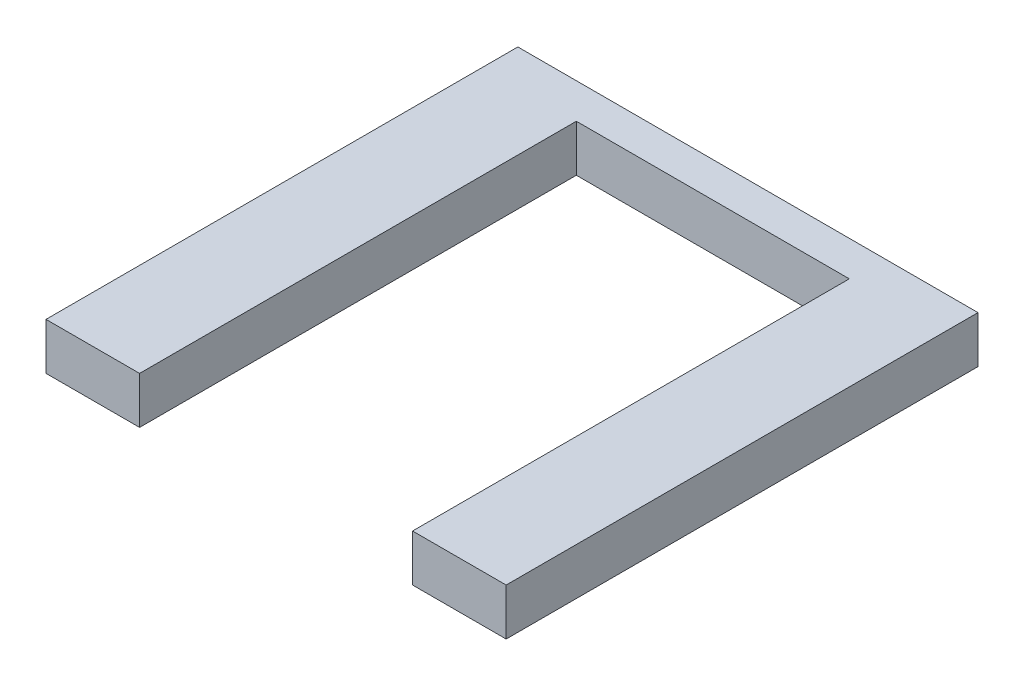
ISO-10303-21;
HEADER;
FILE_DESCRIPTION(('STEP AP214'),'2;1');
FILE_NAME('part.step','',(''),(''),'','','');
FILE_SCHEMA(('AUTOMOTIVE_DESIGN { 1 0 10303 214 1 1 1 1 }'));
ENDSEC;
DATA;
#1=APPLICATION_CONTEXT('core data for automotive mechanical design processes');
#2=APPLICATION_PROTOCOL_DEFINITION('international standard','automotive_design',2000,#1);
#3=PRODUCT_CONTEXT('',#1,'mechanical');
#4=PRODUCT('Part','Part','',(#3));
#5=PRODUCT_RELATED_PRODUCT_CATEGORY('part','',(#4));
#6=PRODUCT_DEFINITION_FORMATION('','',#4);
#7=PRODUCT_DEFINITION_CONTEXT('part definition',#1,'design');
#8=PRODUCT_DEFINITION('design','',#6,#7);
#9=PRODUCT_DEFINITION_SHAPE('','',#8);
#10=(LENGTH_UNIT() NAMED_UNIT(*) SI_UNIT(.MILLI.,.METRE.));
#11=(NAMED_UNIT(*) PLANE_ANGLE_UNIT() SI_UNIT($,.RADIAN.));
#12=(NAMED_UNIT(*) SI_UNIT($,.STERADIAN.) SOLID_ANGLE_UNIT());
#13=UNCERTAINTY_MEASURE_WITH_UNIT(LENGTH_MEASURE(1.E-05),#10,'distance_accuracy_value','');
#14=(GEOMETRIC_REPRESENTATION_CONTEXT(3) GLOBAL_UNCERTAINTY_ASSIGNED_CONTEXT((#13)) GLOBAL_UNIT_ASSIGNED_CONTEXT((#10,
#11,#12)) REPRESENTATION_CONTEXT('',''));
#15=CARTESIAN_POINT('',(0.,0.,0.));
#16=DIRECTION('',(0.,0.,1.));
#17=DIRECTION('',(1.,0.,0.));
#18=AXIS2_PLACEMENT_3D('',#15,#16,#17);
#19=CARTESIAN_POINT('',(0.,76.2,768.35));
#20=DIRECTION('',(0.,0.,-1.));
#21=DIRECTION('',(-1.,0.,0.));
#22=AXIS2_PLACEMENT_3D('',#19,#20,#21);
#23=PLANE('',#22);
#24=DIRECTION('',(1.,0.,0.));
#25=VECTOR('',#24,1.);
#26=CARTESIAN_POINT('',(0.,0.,768.35));
#27=LINE('',#26,#25);
#28=CARTESIAN_POINT('',(0.,0.,768.35));
#29=VERTEX_POINT('',#28);
#30=CARTESIAN_POINT('',(152.4,0.,768.35));
#31=VERTEX_POINT('',#30);
#32=EDGE_CURVE('E134',#29,#31,#27,.T.);
#33=ORIENTED_EDGE('',*,*,#32,.T.);
#34=DIRECTION('',(0.,1.,0.));
#35=VECTOR('',#34,1.);
#36=CARTESIAN_POINT('',(152.4,0.,768.35));
#37=LINE('',#36,#35);
#38=CARTESIAN_POINT('',(152.4,76.2,768.35));
#39=VERTEX_POINT('',#38);
#40=EDGE_CURVE('E121',#31,#39,#37,.T.);
#41=ORIENTED_EDGE('',*,*,#40,.T.);
#42=DIRECTION('',(1.,0.,0.));
#43=VECTOR('',#42,1.);
#44=CARTESIAN_POINT('',(0.,76.2,768.35));
#45=LINE('',#44,#43);
#46=CARTESIAN_POINT('',(0.,76.2,768.35));
#47=VERTEX_POINT('',#46);
#48=EDGE_CURVE('E98',#47,#39,#45,.T.);
#49=ORIENTED_EDGE('',*,*,#48,.F.);
#50=DIRECTION('',(0.,-1.,0.));
#51=VECTOR('',#50,1.);
#52=CARTESIAN_POINT('',(0.,76.2,768.35));
#53=LINE('',#52,#51);
#54=EDGE_CURVE('E11',#47,#29,#53,.T.);
#55=ORIENTED_EDGE('',*,*,#54,.T.);
#56=EDGE_LOOP('',(#33,#41,#49,#55));
#57=FACE_BOUND('',#56,.T.);
#58=ADVANCED_FACE('F38',(#57),#23,.F.);
#59=CARTESIAN_POINT('',(0.,76.2,0.));
#60=DIRECTION('',(1.,0.,0.));
#61=DIRECTION('',(0.,0.,-1.));
#62=AXIS2_PLACEMENT_3D('',#59,#60,#61);
#63=PLANE('',#62);
#64=DIRECTION('',(0.,0.,1.));
#65=VECTOR('',#64,1.);
#66=CARTESIAN_POINT('',(0.,0.,0.));
#67=LINE('',#66,#65);
#68=CARTESIAN_POINT('',(0.,0.,0.));
#69=VERTEX_POINT('',#68);
#70=EDGE_CURVE('E148',#69,#29,#67,.T.);
#71=ORIENTED_EDGE('',*,*,#70,.T.);
#72=ORIENTED_EDGE('',*,*,#54,.F.);
#73=DIRECTION('',(0.,0.,1.));
#74=VECTOR('',#73,1.);
#75=CARTESIAN_POINT('',(0.,76.2,0.));
#76=LINE('',#75,#74);
#77=CARTESIAN_POINT('',(0.,76.2,0.));
#78=VERTEX_POINT('',#77);
#79=EDGE_CURVE('E154',#78,#47,#76,.T.);
#80=ORIENTED_EDGE('',*,*,#79,.F.);
#81=DIRECTION('',(0.,-1.,0.));
#82=VECTOR('',#81,1.);
#83=CARTESIAN_POINT('',(0.,76.2,0.));
#84=LINE('',#83,#82);
#85=EDGE_CURVE('E155',#78,#69,#84,.T.);
#86=ORIENTED_EDGE('',*,*,#85,.T.);
#87=EDGE_LOOP('',(#71,#72,#80,#86));
#88=FACE_BOUND('',#87,.T.);
#89=ADVANCED_FACE('F40',(#88),#63,.F.);
#90=CARTESIAN_POINT('',(596.9,76.2,768.35));
#91=VERTEX_POINT('',#90);
#92=CARTESIAN_POINT('',(749.3,76.2,768.35));
#93=VERTEX_POINT('',#92);
#94=EDGE_CURVE('E186',#91,#93,#45,.T.);
#95=ORIENTED_EDGE('',*,*,#94,.F.);
#96=DIRECTION('',(0.,1.,0.));
#97=VECTOR('',#96,1.);
#98=CARTESIAN_POINT('',(596.9,0.,768.35));
#99=LINE('',#98,#97);
#100=CARTESIAN_POINT('',(596.9,0.,768.35));
#101=VERTEX_POINT('',#100);
#102=EDGE_CURVE('E129',#101,#91,#99,.T.);
#103=ORIENTED_EDGE('',*,*,#102,.F.);
#104=CARTESIAN_POINT('',(749.3,0.,768.35));
#105=VERTEX_POINT('',#104);
#106=EDGE_CURVE('E144',#101,#105,#27,.T.);
#107=ORIENTED_EDGE('',*,*,#106,.T.);
#108=DIRECTION('',(0.,-1.,0.));
#109=VECTOR('',#108,1.);
#110=CARTESIAN_POINT('',(749.3,76.2,768.35));
#111=LINE('',#110,#109);
#112=EDGE_CURVE('E47',#93,#105,#111,.T.);
#113=ORIENTED_EDGE('',*,*,#112,.F.);
#114=EDGE_LOOP('',(#95,#103,#107,#113));
#115=FACE_BOUND('',#114,.T.);
#116=ADVANCED_FACE('F205',(#115),#23,.F.);
#117=CARTESIAN_POINT('',(749.3,76.2,0.));
#118=DIRECTION('',(-1.,0.,0.));
#119=DIRECTION('',(0.,0.,1.));
#120=AXIS2_PLACEMENT_3D('',#117,#118,#119);
#121=PLANE('',#120);
#122=DIRECTION('',(0.,0.,-1.));
#123=VECTOR('',#122,1.);
#124=CARTESIAN_POINT('',(749.3,0.,0.));
#125=LINE('',#124,#123);
#126=CARTESIAN_POINT('',(749.3,0.,0.));
#127=VERTEX_POINT('',#126);
#128=EDGE_CURVE('E143',#105,#127,#125,.T.);
#129=ORIENTED_EDGE('',*,*,#128,.T.);
#130=DIRECTION('',(0.,-1.,0.));
#131=VECTOR('',#130,1.);
#132=CARTESIAN_POINT('',(749.3,76.2,0.));
#133=LINE('',#132,#131);
#134=CARTESIAN_POINT('',(749.3,76.2,0.));
#135=VERTEX_POINT('',#134);
#136=EDGE_CURVE('E158',#135,#127,#133,.T.);
#137=ORIENTED_EDGE('',*,*,#136,.F.);
#138=DIRECTION('',(0.,0.,-1.));
#139=VECTOR('',#138,1.);
#140=CARTESIAN_POINT('',(749.3,76.2,0.));
#141=LINE('',#140,#139);
#142=EDGE_CURVE('E166',#93,#135,#141,.T.);
#143=ORIENTED_EDGE('',*,*,#142,.F.);
#144=ORIENTED_EDGE('',*,*,#112,.T.);
#145=EDGE_LOOP('',(#129,#137,#143,#144));
#146=FACE_BOUND('',#145,.T.);
#147=ADVANCED_FACE('F164',(#146),#121,.F.);
#148=CARTESIAN_POINT('',(0.,76.2,0.));
#149=DIRECTION('',(0.,0.,1.));
#150=DIRECTION('',(1.,0.,0.));
#151=AXIS2_PLACEMENT_3D('',#148,#149,#150);
#152=PLANE('',#151);
#153=DIRECTION('',(-1.,0.,0.));
#154=VECTOR('',#153,1.);
#155=CARTESIAN_POINT('',(0.,0.,0.));
#156=LINE('',#155,#154);
#157=EDGE_CURVE('E90',#127,#69,#156,.T.);
#158=ORIENTED_EDGE('',*,*,#157,.T.);
#159=ORIENTED_EDGE('',*,*,#85,.F.);
#160=DIRECTION('',(-1.,0.,0.));
#161=VECTOR('',#160,1.);
#162=CARTESIAN_POINT('',(0.,76.2,0.));
#163=LINE('',#162,#161);
#164=EDGE_CURVE('E68',#135,#78,#163,.T.);
#165=ORIENTED_EDGE('',*,*,#164,.F.);
#166=ORIENTED_EDGE('',*,*,#136,.T.);
#167=EDGE_LOOP('',(#158,#159,#165,#166));
#168=FACE_BOUND('',#167,.T.);
#169=ADVANCED_FACE('F216',(#168),#152,.F.);
#170=CARTESIAN_POINT('',(0.,76.2,0.));
#171=DIRECTION('',(0.,1.,0.));
#172=DIRECTION('',(0.,0.,1.));
#173=AXIS2_PLACEMENT_3D('',#170,#171,#172);
#174=PLANE('',#173);
#175=DIRECTION('',(0.,0.,1.));
#176=VECTOR('',#175,1.);
#177=CARTESIAN_POINT('',(152.4,76.2,57.15));
#178=LINE('',#177,#176);
#179=CARTESIAN_POINT('',(152.4,76.2,57.15));
#180=VERTEX_POINT('',#179);
#181=EDGE_CURVE('E126',#180,#39,#178,.T.);
#182=ORIENTED_EDGE('',*,*,#181,.F.);
#183=DIRECTION('',(-1.,0.,0.));
#184=VECTOR('',#183,1.);
#185=CARTESIAN_POINT('',(152.4,76.2,57.15));
#186=LINE('',#185,#184);
#187=CARTESIAN_POINT('',(596.9,76.2,57.15));
#188=VERTEX_POINT('',#187);
#189=EDGE_CURVE('E138',#188,#180,#186,.T.);
#190=ORIENTED_EDGE('',*,*,#189,.F.);
#191=DIRECTION('',(0.,0.,-1.));
#192=VECTOR('',#191,1.);
#193=CARTESIAN_POINT('',(596.9,76.2,57.15));
#194=LINE('',#193,#192);
#195=EDGE_CURVE('E191',#91,#188,#194,.T.);
#196=ORIENTED_EDGE('',*,*,#195,.F.);
#197=ORIENTED_EDGE('',*,*,#94,.T.);
#198=ORIENTED_EDGE('',*,*,#142,.T.);
#199=ORIENTED_EDGE('',*,*,#164,.T.);
#200=ORIENTED_EDGE('',*,*,#79,.T.);
#201=ORIENTED_EDGE('',*,*,#48,.T.);
#202=EDGE_LOOP('',(#182,#190,#196,#197,#198,#199,#200,#201));
#203=FACE_BOUND('',#202,.T.);
#204=ADVANCED_FACE('F202',(#203),#174,.T.);
#205=CARTESIAN_POINT('',(0.,0.,0.));
#206=DIRECTION('',(0.,1.,0.));
#207=DIRECTION('',(0.,0.,1.));
#208=AXIS2_PLACEMENT_3D('',#205,#206,#207);
#209=PLANE('',#208);
#210=DIRECTION('',(-1.,0.,0.));
#211=VECTOR('',#210,1.);
#212=CARTESIAN_POINT('',(152.4,0.,57.15));
#213=LINE('',#212,#211);
#214=CARTESIAN_POINT('',(596.9,0.,57.15));
#215=VERTEX_POINT('',#214);
#216=CARTESIAN_POINT('',(152.4,0.,57.15));
#217=VERTEX_POINT('',#216);
#218=EDGE_CURVE('E57',#215,#217,#213,.T.);
#219=ORIENTED_EDGE('',*,*,#218,.T.);
#220=DIRECTION('',(0.,0.,1.));
#221=VECTOR('',#220,1.);
#222=CARTESIAN_POINT('',(152.4,0.,57.15));
#223=LINE('',#222,#221);
#224=EDGE_CURVE('E124',#217,#31,#223,.T.);
#225=ORIENTED_EDGE('',*,*,#224,.T.);
#226=ORIENTED_EDGE('',*,*,#32,.F.);
#227=ORIENTED_EDGE('',*,*,#70,.F.);
#228=ORIENTED_EDGE('',*,*,#157,.F.);
#229=ORIENTED_EDGE('',*,*,#128,.F.);
#230=ORIENTED_EDGE('',*,*,#106,.F.);
#231=DIRECTION('',(0.,0.,-1.));
#232=VECTOR('',#231,1.);
#233=CARTESIAN_POINT('',(596.9,0.,57.15));
#234=LINE('',#233,#232);
#235=EDGE_CURVE('E137',#101,#215,#234,.T.);
#236=ORIENTED_EDGE('',*,*,#235,.T.);
#237=EDGE_LOOP('',(#219,#225,#226,#227,#228,#229,#230,#236));
#238=FACE_BOUND('',#237,.T.);
#239=ADVANCED_FACE('F132',(#238),#209,.F.);
#240=CARTESIAN_POINT('',(152.4,0.,57.15));
#241=DIRECTION('',(-1.,0.,0.));
#242=DIRECTION('',(0.,0.,1.));
#243=AXIS2_PLACEMENT_3D('',#240,#241,#242);
#244=PLANE('',#243);
#245=ORIENTED_EDGE('',*,*,#181,.T.);
#246=ORIENTED_EDGE('',*,*,#40,.F.);
#247=ORIENTED_EDGE('',*,*,#224,.F.);
#248=DIRECTION('',(0.,1.,0.));
#249=VECTOR('',#248,1.);
#250=CARTESIAN_POINT('',(152.4,0.,57.15));
#251=LINE('',#250,#249);
#252=EDGE_CURVE('E172',#217,#180,#251,.T.);
#253=ORIENTED_EDGE('',*,*,#252,.T.);
#254=EDGE_LOOP('',(#245,#246,#247,#253));
#255=FACE_BOUND('',#254,.T.);
#256=ADVANCED_FACE('F123',(#255),#244,.F.);
#257=CARTESIAN_POINT('',(152.4,0.,57.15));
#258=DIRECTION('',(0.,0.,-1.));
#259=DIRECTION('',(-1.,0.,0.));
#260=AXIS2_PLACEMENT_3D('',#257,#258,#259);
#261=PLANE('',#260);
#262=ORIENTED_EDGE('',*,*,#189,.T.);
#263=ORIENTED_EDGE('',*,*,#252,.F.);
#264=ORIENTED_EDGE('',*,*,#218,.F.);
#265=DIRECTION('',(0.,1.,0.));
#266=VECTOR('',#265,1.);
#267=CARTESIAN_POINT('',(596.9,0.,57.15));
#268=LINE('',#267,#266);
#269=EDGE_CURVE('E175',#215,#188,#268,.T.);
#270=ORIENTED_EDGE('',*,*,#269,.T.);
#271=EDGE_LOOP('',(#262,#263,#264,#270));
#272=FACE_BOUND('',#271,.T.);
#273=ADVANCED_FACE('F200',(#272),#261,.F.);
#274=CARTESIAN_POINT('',(596.9,0.,57.15));
#275=DIRECTION('',(1.,0.,0.));
#276=DIRECTION('',(0.,0.,-1.));
#277=AXIS2_PLACEMENT_3D('',#274,#275,#276);
#278=PLANE('',#277);
#279=ORIENTED_EDGE('',*,*,#195,.T.);
#280=ORIENTED_EDGE('',*,*,#269,.F.);
#281=ORIENTED_EDGE('',*,*,#235,.F.);
#282=ORIENTED_EDGE('',*,*,#102,.T.);
#283=EDGE_LOOP('',(#279,#280,#281,#282));
#284=FACE_BOUND('',#283,.T.);
#285=ADVANCED_FACE('F224',(#284),#278,.F.);
#286=CLOSED_SHELL('',(#58,#89,#116,#147,#169,#204,#239,#256,#273,#285));
#287=MANIFOLD_SOLID_BREP('B2',#286);
#288=ADVANCED_BREP_SHAPE_REPRESENTATION('',(#18,#287),#14);
#289=SHAPE_DEFINITION_REPRESENTATION(#9,#288);
ENDSEC;
END-ISO-10303-21;
